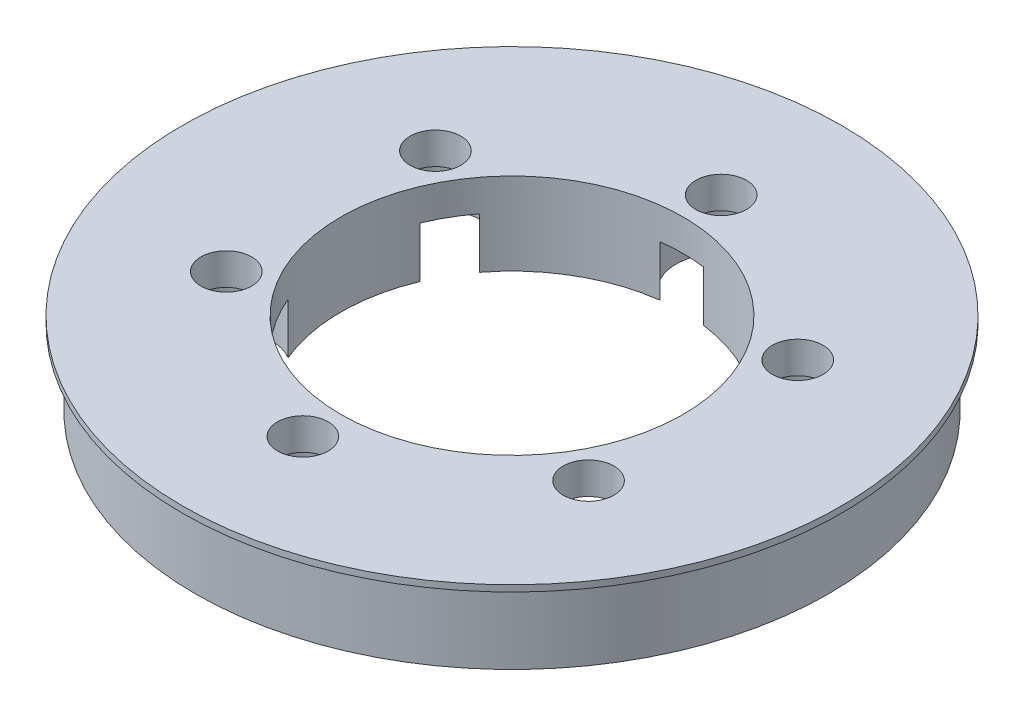
ISO-10303-21;
HEADER;
FILE_DESCRIPTION(('STEP AP214'),'2;1');
FILE_NAME('part.step','',(''),(''),'','','');
FILE_SCHEMA(('AUTOMOTIVE_DESIGN { 1 0 10303 214 1 1 1 1 }'));
ENDSEC;
DATA;
#1=APPLICATION_CONTEXT('core data for automotive mechanical design processes');
#2=APPLICATION_PROTOCOL_DEFINITION('international standard','automotive_design',2000,#1);
#3=PRODUCT_CONTEXT('',#1,'mechanical');
#4=PRODUCT('Part','Part','',(#3));
#5=PRODUCT_RELATED_PRODUCT_CATEGORY('part','',(#4));
#6=PRODUCT_DEFINITION_FORMATION('','',#4);
#7=PRODUCT_DEFINITION_CONTEXT('part definition',#1,'design');
#8=PRODUCT_DEFINITION('design','',#6,#7);
#9=PRODUCT_DEFINITION_SHAPE('','',#8);
#10=(LENGTH_UNIT() NAMED_UNIT(*) SI_UNIT(.MILLI.,.METRE.));
#11=(NAMED_UNIT(*) PLANE_ANGLE_UNIT() SI_UNIT($,.RADIAN.));
#12=(NAMED_UNIT(*) SI_UNIT($,.STERADIAN.) SOLID_ANGLE_UNIT());
#13=UNCERTAINTY_MEASURE_WITH_UNIT(LENGTH_MEASURE(1.E-05),#10,'distance_accuracy_value','');
#14=(GEOMETRIC_REPRESENTATION_CONTEXT(3) GLOBAL_UNCERTAINTY_ASSIGNED_CONTEXT((#13)) GLOBAL_UNIT_ASSIGNED_CONTEXT((#10,
#11,#12)) REPRESENTATION_CONTEXT('',''));
#15=CARTESIAN_POINT('',(0.,0.,0.));
#16=DIRECTION('',(0.,0.,1.));
#17=DIRECTION('',(1.,0.,0.));
#18=AXIS2_PLACEMENT_3D('',#15,#16,#17);
#19=CARTESIAN_POINT('',(0.,6.,0.));
#20=DIRECTION('',(0.,-1.,0.));
#21=DIRECTION('',(0.,0.,-1.));
#22=AXIS2_PLACEMENT_3D('',#19,#20,#21);
#23=CYLINDRICAL_SURFACE('',#22,13.5);
#24=CARTESIAN_POINT('',(0.,4.,0.));
#25=DIRECTION('',(0.,1.,0.));
#26=DIRECTION('',(0.,0.,1.));
#27=AXIS2_PLACEMENT_3D('',#24,#25,#26);
#28=CIRCLE('',#27,13.5);
#29=CARTESIAN_POINT('',(12.4534789480457,4.,-5.21160839766213));
#30=VERTEX_POINT('',#29);
#31=CARTESIAN_POINT('',(10.7401247409744,4.,-8.17922493567147));
#32=VERTEX_POINT('',#31);
#33=EDGE_CURVE('E145',#30,#32,#28,.T.);
#34=ORIENTED_EDGE('',*,*,#33,.F.);
#35=DIRECTION('',(0.,-1.,0.));
#36=VECTOR('',#35,1.);
#37=CARTESIAN_POINT('',(12.4534789480457,2.,-5.21160839766214));
#38=LINE('',#37,#36);
#39=CARTESIAN_POINT('',(12.4534789480457,0.,-5.21160839766214));
#40=VERTEX_POINT('',#39);
#41=EDGE_CURVE('E132',#30,#40,#38,.T.);
#42=ORIENTED_EDGE('',*,*,#41,.T.);
#43=CARTESIAN_POINT('',(0.,0.,0.));
#44=DIRECTION('',(0.,1.,0.));
#45=DIRECTION('',(0.,0.,1.));
#46=AXIS2_PLACEMENT_3D('',#43,#44,#45);
#47=CIRCLE('',#46,13.5);
#48=CARTESIAN_POINT('',(12.4534789480458,0.,5.21160839766188));
#49=VERTEX_POINT('',#48);
#50=EDGE_CURVE('E144',#49,#40,#47,.T.);
#51=ORIENTED_EDGE('',*,*,#50,.F.);
#52=DIRECTION('',(0.,-1.,0.));
#53=VECTOR('',#52,1.);
#54=CARTESIAN_POINT('',(12.4534789480458,2.,5.21160839766187));
#55=LINE('',#54,#53);
#56=CARTESIAN_POINT('',(12.4534789480458,4.,5.21160839766187));
#57=VERTEX_POINT('',#56);
#58=EDGE_CURVE('E64',#49,#57,#55,.F.);
#59=ORIENTED_EDGE('',*,*,#58,.T.);
#60=CARTESIAN_POINT('',(0.,4.,0.));
#61=DIRECTION('',(0.,1.,0.));
#62=DIRECTION('',(0.,0.,1.));
#63=AXIS2_PLACEMENT_3D('',#60,#61,#62);
#64=CIRCLE('',#63,13.5);
#65=CARTESIAN_POINT('',(10.7401247409746,4.,8.17922493567125));
#66=VERTEX_POINT('',#65);
#67=EDGE_CURVE('E182',#66,#57,#64,.T.);
#68=ORIENTED_EDGE('',*,*,#67,.F.);
#69=DIRECTION('',(0.,-1.,0.));
#70=VECTOR('',#69,1.);
#71=CARTESIAN_POINT('',(10.7401247409746,2.,8.17922493567124));
#72=LINE('',#71,#70);
#73=CARTESIAN_POINT('',(10.7401247409746,0.,8.17922493567124));
#74=VERTEX_POINT('',#73);
#75=EDGE_CURVE('E221',#66,#74,#72,.T.);
#76=ORIENTED_EDGE('',*,*,#75,.T.);
#77=CARTESIAN_POINT('',(1.71335420707128,0.,13.3908333333333));
#78=VERTEX_POINT('',#77);
#79=EDGE_CURVE('E152',#78,#74,#47,.T.);
#80=ORIENTED_EDGE('',*,*,#79,.F.);
#81=DIRECTION('',(0.,-1.,0.));
#82=VECTOR('',#81,1.);
#83=CARTESIAN_POINT('',(1.71335420707128,2.,13.3908333333333));
#84=LINE('',#83,#82);
#85=CARTESIAN_POINT('',(1.71335420707129,4.,13.3908333333333));
#86=VERTEX_POINT('',#85);
#87=EDGE_CURVE('E214',#78,#86,#84,.F.);
#88=ORIENTED_EDGE('',*,*,#87,.T.);
#89=CARTESIAN_POINT('',(0.,4.,0.));
#90=DIRECTION('',(0.,1.,0.));
#91=DIRECTION('',(0.,0.,1.));
#92=AXIS2_PLACEMENT_3D('',#89,#90,#91);
#93=CIRCLE('',#92,13.5);
#94=CARTESIAN_POINT('',(-1.71335420707129,4.,13.3908333333333));
#95=VERTEX_POINT('',#94);
#96=EDGE_CURVE('E185',#95,#86,#93,.T.);
#97=ORIENTED_EDGE('',*,*,#96,.F.);
#98=DIRECTION('',(0.,-1.,0.));
#99=VECTOR('',#98,1.);
#100=CARTESIAN_POINT('',(-1.71335420707128,2.,13.3908333333333));
#101=LINE('',#100,#99);
#102=CARTESIAN_POINT('',(-1.71335420707128,0.,13.3908333333333));
#103=VERTEX_POINT('',#102);
#104=EDGE_CURVE('E217',#95,#103,#101,.T.);
#105=ORIENTED_EDGE('',*,*,#104,.T.);
#106=CARTESIAN_POINT('',(-10.7401247409744,0.,8.17922493567139));
#107=VERTEX_POINT('',#106);
#108=EDGE_CURVE('E155',#107,#103,#47,.T.);
#109=ORIENTED_EDGE('',*,*,#108,.F.);
#110=DIRECTION('',(0.,-1.,0.));
#111=VECTOR('',#110,1.);
#112=CARTESIAN_POINT('',(-10.7401247409744,2.,8.17922493567139));
#113=LINE('',#112,#111);
#114=CARTESIAN_POINT('',(-10.7401247409744,4.,8.17922493567139));
#115=VERTEX_POINT('',#114);
#116=EDGE_CURVE('E208',#107,#115,#113,.F.);
#117=ORIENTED_EDGE('',*,*,#116,.T.);
#118=CARTESIAN_POINT('',(0.,4.,0.));
#119=DIRECTION('',(0.,1.,0.));
#120=DIRECTION('',(0.,0.,1.));
#121=AXIS2_PLACEMENT_3D('',#118,#119,#120);
#122=CIRCLE('',#121,13.5);
#123=CARTESIAN_POINT('',(-12.4534789480457,4.,5.21160839766205));
#124=VERTEX_POINT('',#123);
#125=EDGE_CURVE('E188',#124,#115,#122,.T.);
#126=ORIENTED_EDGE('',*,*,#125,.F.);
#127=DIRECTION('',(0.,-1.,0.));
#128=VECTOR('',#127,1.);
#129=CARTESIAN_POINT('',(-12.4534789480457,2.,5.21160839766205));
#130=LINE('',#129,#128);
#131=CARTESIAN_POINT('',(-12.4534789480457,0.,5.21160839766205));
#132=VERTEX_POINT('',#131);
#133=EDGE_CURVE('E211',#124,#132,#130,.T.);
#134=ORIENTED_EDGE('',*,*,#133,.T.);
#135=CARTESIAN_POINT('',(-12.4534789480458,0.,-5.21160839766197));
#136=VERTEX_POINT('',#135);
#137=EDGE_CURVE('E162',#136,#132,#47,.T.);
#138=ORIENTED_EDGE('',*,*,#137,.F.);
#139=DIRECTION('',(0.,-1.,0.));
#140=VECTOR('',#139,1.);
#141=CARTESIAN_POINT('',(-12.4534789480458,2.,-5.21160839766196));
#142=LINE('',#141,#140);
#143=CARTESIAN_POINT('',(-12.4534789480458,4.,-5.21160839766196));
#144=VERTEX_POINT('',#143);
#145=EDGE_CURVE('E202',#136,#144,#142,.F.);
#146=ORIENTED_EDGE('',*,*,#145,.T.);
#147=CARTESIAN_POINT('',(0.,4.,0.));
#148=DIRECTION('',(0.,1.,0.));
#149=DIRECTION('',(0.,0.,1.));
#150=AXIS2_PLACEMENT_3D('',#147,#148,#149);
#151=CIRCLE('',#150,13.5);
#152=CARTESIAN_POINT('',(-10.7401247409745,4.,-8.17922493567132));
#153=VERTEX_POINT('',#152);
#154=EDGE_CURVE('E200',#153,#144,#151,.T.);
#155=ORIENTED_EDGE('',*,*,#154,.F.);
#156=DIRECTION('',(0.,-1.,0.));
#157=VECTOR('',#156,1.);
#158=CARTESIAN_POINT('',(-10.7401247409745,2.,-8.17922493567131));
#159=LINE('',#158,#157);
#160=CARTESIAN_POINT('',(-10.7401247409745,0.,-8.17922493567131));
#161=VERTEX_POINT('',#160);
#162=EDGE_CURVE('E205',#153,#161,#159,.T.);
#163=ORIENTED_EDGE('',*,*,#162,.T.);
#164=CARTESIAN_POINT('',(-1.71335420707129,0.,-13.3908333333333));
#165=VERTEX_POINT('',#164);
#166=EDGE_CURVE('E157',#165,#161,#47,.T.);
#167=ORIENTED_EDGE('',*,*,#166,.F.);
#168=DIRECTION('',(0.,-1.,0.));
#169=VECTOR('',#168,1.);
#170=CARTESIAN_POINT('',(-1.71335420707128,2.,-13.3908333333333));
#171=LINE('',#170,#169);
#172=CARTESIAN_POINT('',(-1.71335420707129,4.,-13.3908333333333));
#173=VERTEX_POINT('',#172);
#174=EDGE_CURVE('E48',#165,#173,#171,.F.);
#175=ORIENTED_EDGE('',*,*,#174,.T.);
#176=CARTESIAN_POINT('',(0.,4.,0.));
#177=DIRECTION('',(0.,1.,0.));
#178=DIRECTION('',(0.,0.,1.));
#179=AXIS2_PLACEMENT_3D('',#176,#177,#178);
#180=CIRCLE('',#179,13.5);
#181=CARTESIAN_POINT('',(1.71335420707129,4.,-13.3908333333333));
#182=VERTEX_POINT('',#181);
#183=EDGE_CURVE('E156',#182,#173,#180,.T.);
#184=ORIENTED_EDGE('',*,*,#183,.F.);
#185=DIRECTION('',(0.,-1.,0.));
#186=VECTOR('',#185,1.);
#187=CARTESIAN_POINT('',(1.71335420707128,2.,-13.3908333333333));
#188=LINE('',#187,#186);
#189=CARTESIAN_POINT('',(1.71335420707129,0.,-13.3908333333333));
#190=VERTEX_POINT('',#189);
#191=EDGE_CURVE('E11',#182,#190,#188,.T.);
#192=ORIENTED_EDGE('',*,*,#191,.T.);
#193=CARTESIAN_POINT('',(10.7401247409744,0.,-8.17922493567146));
#194=VERTEX_POINT('',#193);
#195=EDGE_CURVE('E153',#194,#190,#47,.T.);
#196=ORIENTED_EDGE('',*,*,#195,.F.);
#197=DIRECTION('',(0.,-1.,0.));
#198=VECTOR('',#197,1.);
#199=CARTESIAN_POINT('',(10.7401247409744,2.,-8.17922493567146));
#200=LINE('',#199,#198);
#201=EDGE_CURVE('E56',#194,#32,#200,.F.);
#202=ORIENTED_EDGE('',*,*,#201,.T.);
#203=EDGE_LOOP('',(#34,#42,#51,#59,#68,#76,#80,#88,#97,#105,#109,#117,#126,#134,#138,#146,#155,
#163,#167,#175,#184,#192,#196,#202));
#204=FACE_BOUND('',#203,.T.);
#205=CARTESIAN_POINT('',(0.,6.5,0.));
#206=DIRECTION('',(0.,1.,0.));
#207=DIRECTION('',(0.,0.,1.));
#208=AXIS2_PLACEMENT_3D('',#205,#206,#207);
#209=CIRCLE('',#208,13.5);
#210=CARTESIAN_POINT('',(0.,6.5,13.5));
#211=VERTEX_POINT('',#210);
#212=EDGE_CURVE('E273',#211,#211,#209,.T.);
#213=ORIENTED_EDGE('',*,*,#212,.T.);
#214=EDGE_LOOP('',(#213));
#215=FACE_BOUND('',#214,.T.);
#216=ADVANCED_FACE('F39',(#204,#215),#23,.F.);
#217=CARTESIAN_POINT('',(0.,0.,0.));
#218=DIRECTION('',(0.,1.,0.));
#219=DIRECTION('',(0.,0.,1.));
#220=AXIS2_PLACEMENT_3D('',#217,#218,#219);
#221=PLANE('',#220);
#222=CARTESIAN_POINT('',(14.2894191624431,0.,-8.25000000000017));
#223=DIRECTION('',(0.,1.,0.));
#224=DIRECTION('',(-0.866025403784433,0.,0.50000000000001));
#225=AXIS2_PLACEMENT_3D('',#222,#223,#224);
#226=CIRCLE('',#225,3.55);
#227=EDGE_CURVE('E129',#40,#194,#226,.T.);
#228=ORIENTED_EDGE('',*,*,#227,.T.);
#229=ORIENTED_EDGE('',*,*,#195,.T.);
#230=CARTESIAN_POINT('',(0.,0.,-16.5));
#231=DIRECTION('',(0.,1.,0.));
#232=DIRECTION('',(0.,0.,1.));
#233=AXIS2_PLACEMENT_3D('',#230,#231,#232);
#234=CIRCLE('',#233,3.55);
#235=EDGE_CURVE('E146',#190,#165,#234,.T.);
#236=ORIENTED_EDGE('',*,*,#235,.T.);
#237=ORIENTED_EDGE('',*,*,#166,.T.);
#238=CARTESIAN_POINT('',(-14.2894191624433,0.,-8.24999999999997));
#239=DIRECTION('',(0.,1.,0.));
#240=DIRECTION('',(0.86602540378444,0.,0.499999999999998));
#241=AXIS2_PLACEMENT_3D('',#238,#239,#240);
#242=CIRCLE('',#241,3.55);
#243=EDGE_CURVE('E238',#161,#136,#242,.T.);
#244=ORIENTED_EDGE('',*,*,#243,.T.);
#245=ORIENTED_EDGE('',*,*,#137,.T.);
#246=CARTESIAN_POINT('',(-14.2894191624432,0.,8.25000000000007));
#247=DIRECTION('',(0.,1.,0.));
#248=DIRECTION('',(0.866025403784436,0.,-0.500000000000004));
#249=AXIS2_PLACEMENT_3D('',#246,#247,#248);
#250=CIRCLE('',#249,3.55);
#251=EDGE_CURVE('E292',#132,#107,#250,.T.);
#252=ORIENTED_EDGE('',*,*,#251,.T.);
#253=ORIENTED_EDGE('',*,*,#108,.T.);
#254=CARTESIAN_POINT('',(0.,0.,16.5));
#255=DIRECTION('',(0.,1.,0.));
#256=DIRECTION('',(0.,0.,-1.));
#257=AXIS2_PLACEMENT_3D('',#254,#255,#256);
#258=CIRCLE('',#257,3.55);
#259=EDGE_CURVE('E297',#103,#78,#258,.T.);
#260=ORIENTED_EDGE('',*,*,#259,.T.);
#261=ORIENTED_EDGE('',*,*,#79,.T.);
#262=CARTESIAN_POINT('',(14.2894191624433,0.,8.24999999999987));
#263=DIRECTION('',(0.,1.,0.));
#264=DIRECTION('',(-0.866025403784443,0.,-0.499999999999992));
#265=AXIS2_PLACEMENT_3D('',#262,#263,#264);
#266=CIRCLE('',#265,3.55);
#267=EDGE_CURVE('E151',#74,#49,#266,.T.);
#268=ORIENTED_EDGE('',*,*,#267,.T.);
#269=ORIENTED_EDGE('',*,*,#50,.T.);
#270=EDGE_LOOP('',(#228,#229,#236,#237,#244,#245,#252,#253,#260,#261,#268,#269));
#271=FACE_BOUND('',#270,.T.);
#272=CARTESIAN_POINT('',(0.,0.,0.));
#273=DIRECTION('',(0.,1.,0.));
#274=DIRECTION('',(0.,0.,1.));
#275=AXIS2_PLACEMENT_3D('',#272,#273,#274);
#276=CIRCLE('',#275,25.);
#277=CARTESIAN_POINT('',(0.,0.,25.));
#278=VERTEX_POINT('',#277);
#279=EDGE_CURVE('E161',#278,#278,#276,.T.);
#280=ORIENTED_EDGE('',*,*,#279,.F.);
#281=EDGE_LOOP('',(#280));
#282=FACE_BOUND('',#281,.T.);
#283=ADVANCED_FACE('F148',(#271,#282),#221,.F.);
#284=CARTESIAN_POINT('',(0.,6.,0.));
#285=DIRECTION('',(0.,-1.,0.));
#286=DIRECTION('',(0.,0.,-1.));
#287=AXIS2_PLACEMENT_3D('',#284,#285,#286);
#288=CYLINDRICAL_SURFACE('',#287,25.);
#289=CARTESIAN_POINT('',(0.,6.,0.));
#290=DIRECTION('',(0.,1.,0.));
#291=DIRECTION('',(0.,0.,1.));
#292=AXIS2_PLACEMENT_3D('',#289,#290,#291);
#293=CIRCLE('',#292,25.);
#294=CARTESIAN_POINT('',(0.,6.,25.));
#295=VERTEX_POINT('',#294);
#296=EDGE_CURVE('E164',#295,#295,#293,.T.);
#297=ORIENTED_EDGE('',*,*,#296,.F.);
#298=EDGE_LOOP('',(#297));
#299=FACE_BOUND('',#298,.T.);
#300=ORIENTED_EDGE('',*,*,#279,.T.);
#301=EDGE_LOOP('',(#300));
#302=FACE_BOUND('',#301,.T.);
#303=ADVANCED_FACE('F41',(#299,#302),#288,.T.);
#304=CARTESIAN_POINT('',(0.,0.,-16.5));
#305=DIRECTION('',(0.,1.,0.));
#306=DIRECTION('',(0.,0.,1.));
#307=AXIS2_PLACEMENT_3D('',#304,#305,#306);
#308=CYLINDRICAL_SURFACE('',#307,2.);
#309=CARTESIAN_POINT('',(0.,4.,-16.5));
#310=DIRECTION('',(0.,1.,0.));
#311=DIRECTION('',(0.,0.,1.));
#312=AXIS2_PLACEMENT_3D('',#309,#310,#311);
#313=CIRCLE('',#312,2.);
#314=CARTESIAN_POINT('',(0.,4.,-14.5));
#315=VERTEX_POINT('',#314);
#316=EDGE_CURVE('E169',#315,#315,#313,.F.);
#317=ORIENTED_EDGE('',*,*,#316,.T.);
#318=EDGE_LOOP('',(#317));
#319=FACE_BOUND('',#318,.T.);
#320=CARTESIAN_POINT('',(0.,6.5,-16.5));
#321=DIRECTION('',(0.,1.,0.));
#322=DIRECTION('',(0.,0.,1.));
#323=AXIS2_PLACEMENT_3D('',#320,#321,#322);
#324=CIRCLE('',#323,2.);
#325=CARTESIAN_POINT('',(0.,6.5,-14.5));
#326=VERTEX_POINT('',#325);
#327=EDGE_CURVE('E263',#326,#326,#324,.T.);
#328=ORIENTED_EDGE('',*,*,#327,.T.);
#329=EDGE_LOOP('',(#328));
#330=FACE_BOUND('',#329,.T.);
#331=ADVANCED_FACE('F254',(#319,#330),#308,.F.);
#332=CARTESIAN_POINT('',(0.,4.,-16.5));
#333=DIRECTION('',(0.,1.,0.));
#334=DIRECTION('',(0.,0.,1.));
#335=AXIS2_PLACEMENT_3D('',#332,#333,#334);
#336=PLANE('',#335);
#337=ORIENTED_EDGE('',*,*,#183,.T.);
#338=CARTESIAN_POINT('',(0.,4.,-16.5));
#339=DIRECTION('',(0.,1.,0.));
#340=DIRECTION('',(0.,0.,1.));
#341=AXIS2_PLACEMENT_3D('',#338,#339,#340);
#342=CIRCLE('',#341,3.55);
#343=EDGE_CURVE('E172',#182,#173,#342,.T.);
#344=ORIENTED_EDGE('',*,*,#343,.F.);
#345=EDGE_LOOP('',(#337,#344));
#346=FACE_BOUND('',#345,.T.);
#347=ORIENTED_EDGE('',*,*,#316,.F.);
#348=EDGE_LOOP('',(#347));
#349=FACE_BOUND('',#348,.T.);
#350=ADVANCED_FACE('F251',(#346,#349),#336,.F.);
#351=CARTESIAN_POINT('',(0.,4.,-16.5));
#352=DIRECTION('',(0.,-1.,0.));
#353=DIRECTION('',(0.,0.,-1.));
#354=AXIS2_PLACEMENT_3D('',#351,#352,#353);
#355=CYLINDRICAL_SURFACE('',#354,3.55);
#356=ORIENTED_EDGE('',*,*,#343,.T.);
#357=ORIENTED_EDGE('',*,*,#174,.F.);
#358=ORIENTED_EDGE('',*,*,#235,.F.);
#359=ORIENTED_EDGE('',*,*,#191,.F.);
#360=EDGE_LOOP('',(#356,#357,#358,#359));
#361=FACE_BOUND('',#360,.T.);
#362=ADVANCED_FACE('F249',(#361),#355,.F.);
#363=CARTESIAN_POINT('',(-14.2894191624433,0.,-8.24999999999997));
#364=DIRECTION('',(0.,1.,0.));
#365=DIRECTION('',(0.,0.,1.));
#366=AXIS2_PLACEMENT_3D('',#363,#364,#365);
#367=CYLINDRICAL_SURFACE('',#366,2.);
#368=CARTESIAN_POINT('',(-14.2894191624433,4.,-8.24999999999997));
#369=DIRECTION('',(0.,1.,0.));
#370=DIRECTION('',(0.,0.,1.));
#371=AXIS2_PLACEMENT_3D('',#368,#369,#370);
#372=CIRCLE('',#371,2.);
#373=CARTESIAN_POINT('',(-14.2894191624433,4.,-6.24999999999997));
#374=VERTEX_POINT('',#373);
#375=EDGE_CURVE('E43',#374,#374,#372,.F.);
#376=ORIENTED_EDGE('',*,*,#375,.T.);
#377=EDGE_LOOP('',(#376));
#378=FACE_BOUND('',#377,.T.);
#379=CARTESIAN_POINT('',(-14.2894191624433,6.5,-8.24999999999997));
#380=DIRECTION('',(0.,1.,0.));
#381=DIRECTION('',(0.,0.,1.));
#382=AXIS2_PLACEMENT_3D('',#379,#380,#381);
#383=CIRCLE('',#382,2.);
#384=CARTESIAN_POINT('',(-14.2894191624433,6.5,-6.24999999999997));
#385=VERTEX_POINT('',#384);
#386=EDGE_CURVE('E265',#385,#385,#383,.T.);
#387=ORIENTED_EDGE('',*,*,#386,.T.);
#388=EDGE_LOOP('',(#387));
#389=FACE_BOUND('',#388,.T.);
#390=ADVANCED_FACE('F337',(#378,#389),#367,.F.);
#391=CARTESIAN_POINT('',(-14.2894191624432,0.,8.25000000000007));
#392=DIRECTION('',(0.,1.,0.));
#393=DIRECTION('',(0.,0.,1.));
#394=AXIS2_PLACEMENT_3D('',#391,#392,#393);
#395=CYLINDRICAL_SURFACE('',#394,2.);
#396=CARTESIAN_POINT('',(-14.2894191624432,4.,8.25000000000007));
#397=DIRECTION('',(0.,1.,0.));
#398=DIRECTION('',(0.,0.,1.));
#399=AXIS2_PLACEMENT_3D('',#396,#397,#398);
#400=CIRCLE('',#399,2.);
#401=CARTESIAN_POINT('',(-14.2894191624432,4.,10.2500000000001));
#402=VERTEX_POINT('',#401);
#403=EDGE_CURVE('E186',#402,#402,#400,.F.);
#404=ORIENTED_EDGE('',*,*,#403,.T.);
#405=EDGE_LOOP('',(#404));
#406=FACE_BOUND('',#405,.T.);
#407=CARTESIAN_POINT('',(-14.2894191624432,6.5,8.25000000000007));
#408=DIRECTION('',(0.,1.,0.));
#409=DIRECTION('',(0.,0.,1.));
#410=AXIS2_PLACEMENT_3D('',#407,#408,#409);
#411=CIRCLE('',#410,2.);
#412=CARTESIAN_POINT('',(-14.2894191624432,6.5,10.2500000000001));
#413=VERTEX_POINT('',#412);
#414=EDGE_CURVE('E268',#413,#413,#411,.T.);
#415=ORIENTED_EDGE('',*,*,#414,.T.);
#416=EDGE_LOOP('',(#415));
#417=FACE_BOUND('',#416,.T.);
#418=ADVANCED_FACE('F335',(#406,#417),#395,.F.);
#419=CARTESIAN_POINT('',(0.,0.,16.5));
#420=DIRECTION('',(0.,1.,0.));
#421=DIRECTION('',(0.,0.,1.));
#422=AXIS2_PLACEMENT_3D('',#419,#420,#421);
#423=CYLINDRICAL_SURFACE('',#422,2.);
#424=CARTESIAN_POINT('',(0.,4.,16.5));
#425=DIRECTION('',(0.,1.,0.));
#426=DIRECTION('',(0.,0.,1.));
#427=AXIS2_PLACEMENT_3D('',#424,#425,#426);
#428=CIRCLE('',#427,2.);
#429=CARTESIAN_POINT('',(0.,4.,18.5));
#430=VERTEX_POINT('',#429);
#431=EDGE_CURVE('E183',#430,#430,#428,.F.);
#432=ORIENTED_EDGE('',*,*,#431,.T.);
#433=EDGE_LOOP('',(#432));
#434=FACE_BOUND('',#433,.T.);
#435=CARTESIAN_POINT('',(0.,6.5,16.5));
#436=DIRECTION('',(0.,1.,0.));
#437=DIRECTION('',(0.,0.,1.));
#438=AXIS2_PLACEMENT_3D('',#435,#436,#437);
#439=CIRCLE('',#438,2.);
#440=CARTESIAN_POINT('',(0.,6.5,18.5));
#441=VERTEX_POINT('',#440);
#442=EDGE_CURVE('E276',#441,#441,#439,.T.);
#443=ORIENTED_EDGE('',*,*,#442,.T.);
#444=EDGE_LOOP('',(#443));
#445=FACE_BOUND('',#444,.T.);
#446=ADVANCED_FACE('F317',(#434,#445),#423,.F.);
#447=CARTESIAN_POINT('',(14.2894191624433,0.,8.24999999999987));
#448=DIRECTION('',(0.,1.,0.));
#449=DIRECTION('',(0.,0.,1.));
#450=AXIS2_PLACEMENT_3D('',#447,#448,#449);
#451=CYLINDRICAL_SURFACE('',#450,2.);
#452=CARTESIAN_POINT('',(14.2894191624433,4.,8.24999999999987));
#453=DIRECTION('',(0.,1.,0.));
#454=DIRECTION('',(0.,0.,1.));
#455=AXIS2_PLACEMENT_3D('',#452,#453,#454);
#456=CIRCLE('',#455,2.);
#457=CARTESIAN_POINT('',(14.2894191624433,4.,10.2499999999999));
#458=VERTEX_POINT('',#457);
#459=EDGE_CURVE('E179',#458,#458,#456,.F.);
#460=ORIENTED_EDGE('',*,*,#459,.T.);
#461=EDGE_LOOP('',(#460));
#462=FACE_BOUND('',#461,.T.);
#463=CARTESIAN_POINT('',(14.2894191624433,6.5,8.24999999999987));
#464=DIRECTION('',(0.,1.,0.));
#465=DIRECTION('',(0.,0.,1.));
#466=AXIS2_PLACEMENT_3D('',#463,#464,#465);
#467=CIRCLE('',#466,2.);
#468=CARTESIAN_POINT('',(14.2894191624433,6.5,10.2499999999999));
#469=VERTEX_POINT('',#468);
#470=EDGE_CURVE('E279',#469,#469,#467,.T.);
#471=ORIENTED_EDGE('',*,*,#470,.T.);
#472=EDGE_LOOP('',(#471));
#473=FACE_BOUND('',#472,.T.);
#474=ADVANCED_FACE('F313',(#462,#473),#451,.F.);
#475=CARTESIAN_POINT('',(14.2894191624431,0.,-8.25000000000017));
#476=DIRECTION('',(0.,1.,0.));
#477=DIRECTION('',(0.,0.,1.));
#478=AXIS2_PLACEMENT_3D('',#475,#476,#477);
#479=CYLINDRICAL_SURFACE('',#478,2.);
#480=CARTESIAN_POINT('',(14.2894191624431,4.,-8.25000000000017));
#481=DIRECTION('',(0.,1.,0.));
#482=DIRECTION('',(0.,0.,1.));
#483=AXIS2_PLACEMENT_3D('',#480,#481,#482);
#484=CIRCLE('',#483,2.);
#485=CARTESIAN_POINT('',(14.2894191624431,4.,-6.25000000000017));
#486=VERTEX_POINT('',#485);
#487=EDGE_CURVE('E175',#486,#486,#484,.F.);
#488=ORIENTED_EDGE('',*,*,#487,.T.);
#489=EDGE_LOOP('',(#488));
#490=FACE_BOUND('',#489,.T.);
#491=CARTESIAN_POINT('',(14.2894191624431,6.5,-8.25000000000017));
#492=DIRECTION('',(0.,1.,0.));
#493=DIRECTION('',(0.,0.,1.));
#494=AXIS2_PLACEMENT_3D('',#491,#492,#493);
#495=CIRCLE('',#494,2.);
#496=CARTESIAN_POINT('',(14.2894191624431,6.5,-6.25000000000017));
#497=VERTEX_POINT('',#496);
#498=EDGE_CURVE('E282',#497,#497,#495,.T.);
#499=ORIENTED_EDGE('',*,*,#498,.T.);
#500=EDGE_LOOP('',(#499));
#501=FACE_BOUND('',#500,.T.);
#502=ADVANCED_FACE('F316',(#490,#501),#479,.F.);
#503=CARTESIAN_POINT('',(14.2894191624431,4.,-8.25000000000017));
#504=DIRECTION('',(0.,1.,0.));
#505=DIRECTION('',(-0.866025403784433,0.,0.50000000000001));
#506=AXIS2_PLACEMENT_3D('',#503,#504,#505);
#507=PLANE('',#506);
#508=ORIENTED_EDGE('',*,*,#33,.T.);
#509=CARTESIAN_POINT('',(14.2894191624431,4.,-8.25000000000017));
#510=DIRECTION('',(0.,1.,0.));
#511=DIRECTION('',(-0.866025403784433,0.,0.50000000000001));
#512=AXIS2_PLACEMENT_3D('',#509,#510,#511);
#513=CIRCLE('',#512,3.55);
#514=EDGE_CURVE('E137',#30,#32,#513,.T.);
#515=ORIENTED_EDGE('',*,*,#514,.F.);
#516=EDGE_LOOP('',(#508,#515));
#517=FACE_BOUND('',#516,.T.);
#518=ORIENTED_EDGE('',*,*,#487,.F.);
#519=EDGE_LOOP('',(#518));
#520=FACE_BOUND('',#519,.T.);
#521=ADVANCED_FACE('F247',(#517,#520),#507,.F.);
#522=CARTESIAN_POINT('',(14.2894191624431,4.,-8.25000000000017));
#523=DIRECTION('',(0.,-1.,0.));
#524=DIRECTION('',(0.,0.,-1.));
#525=AXIS2_PLACEMENT_3D('',#522,#523,#524);
#526=CYLINDRICAL_SURFACE('',#525,3.55);
#527=ORIENTED_EDGE('',*,*,#514,.T.);
#528=ORIENTED_EDGE('',*,*,#201,.F.);
#529=ORIENTED_EDGE('',*,*,#227,.F.);
#530=ORIENTED_EDGE('',*,*,#41,.F.);
#531=EDGE_LOOP('',(#527,#528,#529,#530));
#532=FACE_BOUND('',#531,.T.);
#533=ADVANCED_FACE('F131',(#532),#526,.F.);
#534=CARTESIAN_POINT('',(14.2894191624433,4.,8.24999999999987));
#535=DIRECTION('',(0.,1.,0.));
#536=DIRECTION('',(-0.866025403784443,0.,-0.499999999999992));
#537=AXIS2_PLACEMENT_3D('',#534,#535,#536);
#538=PLANE('',#537);
#539=ORIENTED_EDGE('',*,*,#67,.T.);
#540=CARTESIAN_POINT('',(14.2894191624433,4.,8.24999999999987));
#541=DIRECTION('',(0.,1.,0.));
#542=DIRECTION('',(-0.866025403784443,0.,-0.499999999999992));
#543=AXIS2_PLACEMENT_3D('',#540,#541,#542);
#544=CIRCLE('',#543,3.55);
#545=EDGE_CURVE('E300',#66,#57,#544,.T.);
#546=ORIENTED_EDGE('',*,*,#545,.F.);
#547=EDGE_LOOP('',(#539,#546));
#548=FACE_BOUND('',#547,.T.);
#549=ORIENTED_EDGE('',*,*,#459,.F.);
#550=EDGE_LOOP('',(#549));
#551=FACE_BOUND('',#550,.T.);
#552=ADVANCED_FACE('F307',(#548,#551),#538,.F.);
#553=CARTESIAN_POINT('',(14.2894191624433,4.,8.24999999999987));
#554=DIRECTION('',(0.,-1.,0.));
#555=DIRECTION('',(0.,0.,-1.));
#556=AXIS2_PLACEMENT_3D('',#553,#554,#555);
#557=CYLINDRICAL_SURFACE('',#556,3.55);
#558=ORIENTED_EDGE('',*,*,#545,.T.);
#559=ORIENTED_EDGE('',*,*,#58,.F.);
#560=ORIENTED_EDGE('',*,*,#267,.F.);
#561=ORIENTED_EDGE('',*,*,#75,.F.);
#562=EDGE_LOOP('',(#558,#559,#560,#561));
#563=FACE_BOUND('',#562,.T.);
#564=ADVANCED_FACE('F303',(#563),#557,.F.);
#565=CARTESIAN_POINT('',(0.,4.,16.5));
#566=DIRECTION('',(0.,1.,0.));
#567=DIRECTION('',(0.,0.,-1.));
#568=AXIS2_PLACEMENT_3D('',#565,#566,#567);
#569=PLANE('',#568);
#570=ORIENTED_EDGE('',*,*,#96,.T.);
#571=CARTESIAN_POINT('',(0.,4.,16.5));
#572=DIRECTION('',(0.,1.,0.));
#573=DIRECTION('',(0.,0.,-1.));
#574=AXIS2_PLACEMENT_3D('',#571,#572,#573);
#575=CIRCLE('',#574,3.55);
#576=EDGE_CURVE('E295',#95,#86,#575,.T.);
#577=ORIENTED_EDGE('',*,*,#576,.F.);
#578=EDGE_LOOP('',(#570,#577));
#579=FACE_BOUND('',#578,.T.);
#580=ORIENTED_EDGE('',*,*,#431,.F.);
#581=EDGE_LOOP('',(#580));
#582=FACE_BOUND('',#581,.T.);
#583=ADVANCED_FACE('F512',(#579,#582),#569,.F.);
#584=CARTESIAN_POINT('',(0.,4.,16.5));
#585=DIRECTION('',(0.,-1.,0.));
#586=DIRECTION('',(0.,0.,-1.));
#587=AXIS2_PLACEMENT_3D('',#584,#585,#586);
#588=CYLINDRICAL_SURFACE('',#587,3.55);
#589=ORIENTED_EDGE('',*,*,#576,.T.);
#590=ORIENTED_EDGE('',*,*,#87,.F.);
#591=ORIENTED_EDGE('',*,*,#259,.F.);
#592=ORIENTED_EDGE('',*,*,#104,.F.);
#593=EDGE_LOOP('',(#589,#590,#591,#592));
#594=FACE_BOUND('',#593,.T.);
#595=ADVANCED_FACE('F500',(#594),#588,.F.);
#596=CARTESIAN_POINT('',(-14.2894191624432,4.,8.25000000000007));
#597=DIRECTION('',(0.,1.,0.));
#598=DIRECTION('',(0.866025403784436,0.,-0.500000000000004));
#599=AXIS2_PLACEMENT_3D('',#596,#597,#598);
#600=PLANE('',#599);
#601=ORIENTED_EDGE('',*,*,#125,.T.);
#602=CARTESIAN_POINT('',(-14.2894191624432,4.,8.25000000000007));
#603=DIRECTION('',(0.,1.,0.));
#604=DIRECTION('',(0.866025403784436,0.,-0.500000000000004));
#605=AXIS2_PLACEMENT_3D('',#602,#603,#604);
#606=CIRCLE('',#605,3.55);
#607=EDGE_CURVE('E243',#124,#115,#606,.T.);
#608=ORIENTED_EDGE('',*,*,#607,.F.);
#609=EDGE_LOOP('',(#601,#608));
#610=FACE_BOUND('',#609,.T.);
#611=ORIENTED_EDGE('',*,*,#403,.F.);
#612=EDGE_LOOP('',(#611));
#613=FACE_BOUND('',#612,.T.);
#614=ADVANCED_FACE('F488',(#610,#613),#600,.F.);
#615=CARTESIAN_POINT('',(-14.2894191624432,4.,8.25000000000007));
#616=DIRECTION('',(0.,-1.,0.));
#617=DIRECTION('',(0.,0.,-1.));
#618=AXIS2_PLACEMENT_3D('',#615,#616,#617);
#619=CYLINDRICAL_SURFACE('',#618,3.55);
#620=ORIENTED_EDGE('',*,*,#607,.T.);
#621=ORIENTED_EDGE('',*,*,#116,.F.);
#622=ORIENTED_EDGE('',*,*,#251,.F.);
#623=ORIENTED_EDGE('',*,*,#133,.F.);
#624=EDGE_LOOP('',(#620,#621,#622,#623));
#625=FACE_BOUND('',#624,.T.);
#626=ADVANCED_FACE('F371',(#625),#619,.F.);
#627=CARTESIAN_POINT('',(-14.2894191624433,4.,-8.24999999999997));
#628=DIRECTION('',(0.,1.,0.));
#629=DIRECTION('',(0.86602540378444,0.,0.499999999999998));
#630=AXIS2_PLACEMENT_3D('',#627,#628,#629);
#631=PLANE('',#630);
#632=ORIENTED_EDGE('',*,*,#154,.T.);
#633=CARTESIAN_POINT('',(-14.2894191624433,4.,-8.24999999999997));
#634=DIRECTION('',(0.,1.,0.));
#635=DIRECTION('',(0.86602540378444,0.,0.499999999999998));
#636=AXIS2_PLACEMENT_3D('',#633,#634,#635);
#637=CIRCLE('',#636,3.55);
#638=EDGE_CURVE('E178',#153,#144,#637,.T.);
#639=ORIENTED_EDGE('',*,*,#638,.F.);
#640=EDGE_LOOP('',(#632,#639));
#641=FACE_BOUND('',#640,.T.);
#642=ORIENTED_EDGE('',*,*,#375,.F.);
#643=EDGE_LOOP('',(#642));
#644=FACE_BOUND('',#643,.T.);
#645=ADVANCED_FACE('F240',(#641,#644),#631,.F.);
#646=CARTESIAN_POINT('',(-14.2894191624433,4.,-8.24999999999997));
#647=DIRECTION('',(0.,-1.,0.));
#648=DIRECTION('',(0.,0.,-1.));
#649=AXIS2_PLACEMENT_3D('',#646,#647,#648);
#650=CYLINDRICAL_SURFACE('',#649,3.55);
#651=ORIENTED_EDGE('',*,*,#638,.T.);
#652=ORIENTED_EDGE('',*,*,#145,.F.);
#653=ORIENTED_EDGE('',*,*,#243,.F.);
#654=ORIENTED_EDGE('',*,*,#162,.F.);
#655=EDGE_LOOP('',(#651,#652,#653,#654));
#656=FACE_BOUND('',#655,.T.);
#657=ADVANCED_FACE('F237',(#656),#650,.F.);
#658=CARTESIAN_POINT('',(0.,6.5,0.));
#659=DIRECTION('',(0.,1.,0.));
#660=DIRECTION('',(0.,0.,1.));
#661=AXIS2_PLACEMENT_3D('',#658,#659,#660);
#662=PLANE('',#661);
#663=ORIENTED_EDGE('',*,*,#386,.F.);
#664=EDGE_LOOP('',(#663));
#665=FACE_BOUND('',#664,.T.);
#666=ORIENTED_EDGE('',*,*,#212,.F.);
#667=EDGE_LOOP('',(#666));
#668=FACE_BOUND('',#667,.T.);
#669=ORIENTED_EDGE('',*,*,#470,.F.);
#670=EDGE_LOOP('',(#669));
#671=FACE_BOUND('',#670,.T.);
#672=CARTESIAN_POINT('',(0.,6.5,0.));
#673=DIRECTION('',(0.,1.,0.));
#674=DIRECTION('',(0.,0.,1.));
#675=AXIS2_PLACEMENT_3D('',#672,#673,#674);
#676=CIRCLE('',#675,26.);
#677=CARTESIAN_POINT('',(0.,6.5,26.));
#678=VERTEX_POINT('',#677);
#679=EDGE_CURVE('E138',#678,#678,#676,.T.);
#680=ORIENTED_EDGE('',*,*,#679,.T.);
#681=EDGE_LOOP('',(#680));
#682=FACE_BOUND('',#681,.T.);
#683=ORIENTED_EDGE('',*,*,#498,.F.);
#684=EDGE_LOOP('',(#683));
#685=FACE_BOUND('',#684,.T.);
#686=ORIENTED_EDGE('',*,*,#442,.F.);
#687=EDGE_LOOP('',(#686));
#688=FACE_BOUND('',#687,.T.);
#689=ORIENTED_EDGE('',*,*,#414,.F.);
#690=EDGE_LOOP('',(#689));
#691=FACE_BOUND('',#690,.T.);
#692=ORIENTED_EDGE('',*,*,#327,.F.);
#693=EDGE_LOOP('',(#692));
#694=FACE_BOUND('',#693,.T.);
#695=ADVANCED_FACE('F321',(#665,#668,#671,#682,#685,#688,#691,#694),#662,.T.);
#696=CARTESIAN_POINT('',(0.,6.,0.));
#697=DIRECTION('',(0.,1.,0.));
#698=DIRECTION('',(0.,0.,1.));
#699=AXIS2_PLACEMENT_3D('',#696,#697,#698);
#700=PLANE('',#699);
#701=ORIENTED_EDGE('',*,*,#296,.T.);
#702=EDGE_LOOP('',(#701));
#703=FACE_BOUND('',#702,.T.);
#704=CARTESIAN_POINT('',(0.,6.,0.));
#705=DIRECTION('',(0.,1.,0.));
#706=DIRECTION('',(0.,0.,1.));
#707=AXIS2_PLACEMENT_3D('',#704,#705,#706);
#708=CIRCLE('',#707,26.);
#709=CARTESIAN_POINT('',(0.,6.,26.));
#710=VERTEX_POINT('',#709);
#711=EDGE_CURVE('E285',#710,#710,#708,.T.);
#712=ORIENTED_EDGE('',*,*,#711,.F.);
#713=EDGE_LOOP('',(#712));
#714=FACE_BOUND('',#713,.T.);
#715=ADVANCED_FACE('F324',(#703,#714),#700,.F.);
#716=CARTESIAN_POINT('',(0.,6.5,0.));
#717=DIRECTION('',(0.,-1.,0.));
#718=DIRECTION('',(0.,0.,-1.));
#719=AXIS2_PLACEMENT_3D('',#716,#717,#718);
#720=CYLINDRICAL_SURFACE('',#719,26.);
#721=ORIENTED_EDGE('',*,*,#679,.F.);
#722=EDGE_LOOP('',(#721));
#723=FACE_BOUND('',#722,.T.);
#724=ORIENTED_EDGE('',*,*,#711,.T.);
#725=EDGE_LOOP('',(#724));
#726=FACE_BOUND('',#725,.T.);
#727=ADVANCED_FACE('F388',(#723,#726),#720,.T.);
#728=CLOSED_SHELL('',(#216,#283,#303,#331,#350,#362,#390,#418,#446,#474,#502,#521,#533,#552,
#564,#583,#595,#614,#626,#645,#657,#695,#715,#727));
#729=MANIFOLD_SOLID_BREP('B2',#728);
#730=ADVANCED_BREP_SHAPE_REPRESENTATION('',(#18,#729),#14);
#731=SHAPE_DEFINITION_REPRESENTATION(#9,#730);
ENDSEC;
END-ISO-10303-21;
